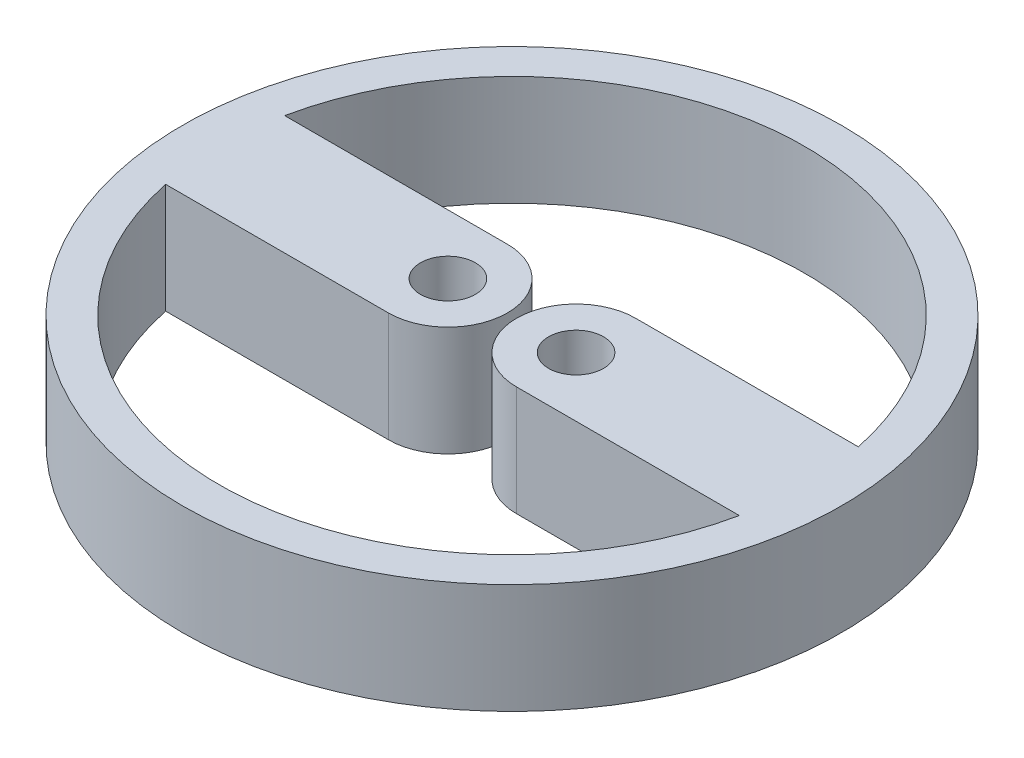
ISO-10303-21;
HEADER;
FILE_DESCRIPTION(('STEP AP214'),'2;1');
FILE_NAME('part.step','',(''),(''),'','','');
FILE_SCHEMA(('AUTOMOTIVE_DESIGN { 1 0 10303 214 1 1 1 1 }'));
ENDSEC;
DATA;
#1=APPLICATION_CONTEXT('core data for automotive mechanical design processes');
#2=APPLICATION_PROTOCOL_DEFINITION('international standard','automotive_design',2000,#1);
#3=PRODUCT_CONTEXT('',#1,'mechanical');
#4=PRODUCT('Part','Part','',(#3));
#5=PRODUCT_RELATED_PRODUCT_CATEGORY('part','',(#4));
#6=PRODUCT_DEFINITION_FORMATION('','',#4);
#7=PRODUCT_DEFINITION_CONTEXT('part definition',#1,'design');
#8=PRODUCT_DEFINITION('design','',#6,#7);
#9=PRODUCT_DEFINITION_SHAPE('','',#8);
#10=(LENGTH_UNIT() NAMED_UNIT(*) SI_UNIT(.MILLI.,.METRE.));
#11=(NAMED_UNIT(*) PLANE_ANGLE_UNIT() SI_UNIT($,.RADIAN.));
#12=(NAMED_UNIT(*) SI_UNIT($,.STERADIAN.) SOLID_ANGLE_UNIT());
#13=UNCERTAINTY_MEASURE_WITH_UNIT(LENGTH_MEASURE(1.E-05),#10,'distance_accuracy_value','');
#14=(GEOMETRIC_REPRESENTATION_CONTEXT(3) GLOBAL_UNCERTAINTY_ASSIGNED_CONTEXT((#13)) GLOBAL_UNIT_ASSIGNED_CONTEXT((#10,
#11,#12)) REPRESENTATION_CONTEXT('',''));
#15=CARTESIAN_POINT('',(0.,0.,0.));
#16=DIRECTION('',(0.,0.,1.));
#17=DIRECTION('',(1.,0.,0.));
#18=AXIS2_PLACEMENT_3D('',#15,#16,#17);
#19=CARTESIAN_POINT('',(0.,6.,0.));
#20=DIRECTION('',(0.,1.,0.));
#21=DIRECTION('',(0.,0.,1.));
#22=AXIS2_PLACEMENT_3D('',#19,#20,#21);
#23=PLANE('',#22);
#24=CARTESIAN_POINT('',(-3.5,6.,0.));
#25=DIRECTION('',(0.,1.,0.));
#26=DIRECTION('',(0.,0.,1.));
#27=AXIS2_PLACEMENT_3D('',#24,#25,#26);
#28=CIRCLE('',#27,1.5);
#29=CARTESIAN_POINT('',(-3.5,6.,1.5));
#30=VERTEX_POINT('',#29);
#31=EDGE_CURVE('E169',#30,#30,#28,.T.);
#32=ORIENTED_EDGE('',*,*,#31,.F.);
#33=EDGE_LOOP('',(#32));
#34=FACE_BOUND('',#33,.T.);
#35=CARTESIAN_POINT('',(0.,6.,0.));
#36=DIRECTION('',(0.,1.,0.));
#37=DIRECTION('',(0.,0.,1.));
#38=AXIS2_PLACEMENT_3D('',#35,#36,#37);
#39=CIRCLE('',#38,18.);
#40=CARTESIAN_POINT('',(0.,6.,18.));
#41=VERTEX_POINT('',#40);
#42=EDGE_CURVE('E11',#41,#41,#39,.T.);
#43=ORIENTED_EDGE('',*,*,#42,.T.);
#44=EDGE_LOOP('',(#43));
#45=FACE_BOUND('',#44,.T.);
#46=CARTESIAN_POINT('',(3.5,6.,0.));
#47=DIRECTION('',(0.,1.,0.));
#48=DIRECTION('',(0.,0.,1.));
#49=AXIS2_PLACEMENT_3D('',#46,#47,#48);
#50=CIRCLE('',#49,1.5);
#51=CARTESIAN_POINT('',(3.5,6.,1.5));
#52=VERTEX_POINT('',#51);
#53=EDGE_CURVE('E163',#52,#52,#50,.T.);
#54=ORIENTED_EDGE('',*,*,#53,.F.);
#55=EDGE_LOOP('',(#54));
#56=FACE_BOUND('',#55,.T.);
#57=DIRECTION('',(-1.,0.,0.));
#58=VECTOR('',#57,1.);
#59=CARTESIAN_POINT('',(3.5,6.,3.25));
#60=LINE('',#59,#58);
#61=CARTESIAN_POINT('',(15.6664450338933,6.,3.25));
#62=VERTEX_POINT('',#61);
#63=CARTESIAN_POINT('',(3.5,6.,3.25));
#64=VERTEX_POINT('',#63);
#65=EDGE_CURVE('E106',#62,#64,#60,.T.);
#66=ORIENTED_EDGE('',*,*,#65,.F.);
#67=CARTESIAN_POINT('',(0.,6.,0.));
#68=DIRECTION('',(0.,1.,0.));
#69=DIRECTION('',(0.,0.,1.));
#70=AXIS2_PLACEMENT_3D('',#67,#68,#69);
#71=CIRCLE('',#70,16.);
#72=CARTESIAN_POINT('',(-15.6664450338933,6.,3.25));
#73=VERTEX_POINT('',#72);
#74=EDGE_CURVE('E98',#73,#62,#71,.T.);
#75=ORIENTED_EDGE('',*,*,#74,.F.);
#76=DIRECTION('',(-1.,0.,0.));
#77=VECTOR('',#76,1.);
#78=CARTESIAN_POINT('',(-3.5,6.,3.25));
#79=LINE('',#78,#77);
#80=CARTESIAN_POINT('',(-3.5,6.,3.25));
#81=VERTEX_POINT('',#80);
#82=EDGE_CURVE('E131',#81,#73,#79,.T.);
#83=ORIENTED_EDGE('',*,*,#82,.F.);
#84=CARTESIAN_POINT('',(-3.5,6.,0.));
#85=DIRECTION('',(0.,-1.,0.));
#86=DIRECTION('',(0.,0.,1.));
#87=AXIS2_PLACEMENT_3D('',#84,#85,#86);
#88=CIRCLE('',#87,3.25);
#89=CARTESIAN_POINT('',(-3.5,6.,-3.25));
#90=VERTEX_POINT('',#89);
#91=EDGE_CURVE('E129',#90,#81,#88,.T.);
#92=ORIENTED_EDGE('',*,*,#91,.F.);
#93=DIRECTION('',(1.,0.,0.));
#94=VECTOR('',#93,1.);
#95=CARTESIAN_POINT('',(-3.5,6.,-3.25));
#96=LINE('',#95,#94);
#97=CARTESIAN_POINT('',(-15.6664450338933,6.,-3.25));
#98=VERTEX_POINT('',#97);
#99=EDGE_CURVE('E127',#98,#90,#96,.T.);
#100=ORIENTED_EDGE('',*,*,#99,.F.);
#101=CARTESIAN_POINT('',(0.,6.,0.));
#102=DIRECTION('',(0.,1.,0.));
#103=DIRECTION('',(0.,0.,1.));
#104=AXIS2_PLACEMENT_3D('',#101,#102,#103);
#105=CIRCLE('',#104,16.);
#106=CARTESIAN_POINT('',(15.6664450338933,6.,-3.25));
#107=VERTEX_POINT('',#106);
#108=EDGE_CURVE('E125',#107,#98,#105,.T.);
#109=ORIENTED_EDGE('',*,*,#108,.F.);
#110=DIRECTION('',(1.,0.,0.));
#111=VECTOR('',#110,1.);
#112=CARTESIAN_POINT('',(3.5,6.,-3.25));
#113=LINE('',#112,#111);
#114=CARTESIAN_POINT('',(3.5,6.,-3.25));
#115=VERTEX_POINT('',#114);
#116=EDGE_CURVE('E121',#115,#107,#113,.T.);
#117=ORIENTED_EDGE('',*,*,#116,.F.);
#118=CARTESIAN_POINT('',(3.5,6.,0.));
#119=DIRECTION('',(0.,-1.,0.));
#120=DIRECTION('',(0.,0.,1.));
#121=AXIS2_PLACEMENT_3D('',#118,#119,#120);
#122=CIRCLE('',#121,3.25);
#123=EDGE_CURVE('E119',#64,#115,#122,.T.);
#124=ORIENTED_EDGE('',*,*,#123,.F.);
#125=EDGE_LOOP('',(#66,#75,#83,#92,#100,#109,#117,#124));
#126=FACE_BOUND('',#125,.T.);
#127=ADVANCED_FACE('F33',(#34,#45,#56,#126),#23,.T.);
#128=CARTESIAN_POINT('',(0.,0.,0.));
#129=DIRECTION('',(0.,1.,0.));
#130=DIRECTION('',(0.,0.,1.));
#131=AXIS2_PLACEMENT_3D('',#128,#129,#130);
#132=PLANE('',#131);
#133=CARTESIAN_POINT('',(3.5,0.,0.));
#134=DIRECTION('',(0.,1.,0.));
#135=DIRECTION('',(0.,0.,1.));
#136=AXIS2_PLACEMENT_3D('',#133,#134,#135);
#137=CIRCLE('',#136,1.5);
#138=CARTESIAN_POINT('',(3.5,0.,1.5));
#139=VERTEX_POINT('',#138);
#140=EDGE_CURVE('E114',#139,#139,#137,.T.);
#141=ORIENTED_EDGE('',*,*,#140,.T.);
#142=EDGE_LOOP('',(#141));
#143=FACE_BOUND('',#142,.T.);
#144=CARTESIAN_POINT('',(-3.5,0.,0.));
#145=DIRECTION('',(0.,1.,0.));
#146=DIRECTION('',(0.,0.,1.));
#147=AXIS2_PLACEMENT_3D('',#144,#145,#146);
#148=CIRCLE('',#147,1.5);
#149=CARTESIAN_POINT('',(-3.5,0.,1.5));
#150=VERTEX_POINT('',#149);
#151=EDGE_CURVE('E166',#150,#150,#148,.T.);
#152=ORIENTED_EDGE('',*,*,#151,.T.);
#153=EDGE_LOOP('',(#152));
#154=FACE_BOUND('',#153,.T.);
#155=CARTESIAN_POINT('',(0.,0.,0.));
#156=DIRECTION('',(0.,1.,0.));
#157=DIRECTION('',(0.,0.,1.));
#158=AXIS2_PLACEMENT_3D('',#155,#156,#157);
#159=CIRCLE('',#158,18.);
#160=CARTESIAN_POINT('',(0.,0.,18.));
#161=VERTEX_POINT('',#160);
#162=EDGE_CURVE('E37',#161,#161,#159,.T.);
#163=ORIENTED_EDGE('',*,*,#162,.F.);
#164=EDGE_LOOP('',(#163));
#165=FACE_BOUND('',#164,.T.);
#166=CARTESIAN_POINT('',(0.,0.,0.));
#167=DIRECTION('',(0.,1.,0.));
#168=DIRECTION('',(0.,0.,1.));
#169=AXIS2_PLACEMENT_3D('',#166,#167,#168);
#170=CIRCLE('',#169,16.);
#171=CARTESIAN_POINT('',(-15.6664450338933,0.,3.25));
#172=VERTEX_POINT('',#171);
#173=CARTESIAN_POINT('',(15.6664450338933,0.,3.25));
#174=VERTEX_POINT('',#173);
#175=EDGE_CURVE('E56',#172,#174,#170,.T.);
#176=ORIENTED_EDGE('',*,*,#175,.T.);
#177=DIRECTION('',(-1.,0.,0.));
#178=VECTOR('',#177,1.);
#179=CARTESIAN_POINT('',(3.5,0.,3.25));
#180=LINE('',#179,#178);
#181=CARTESIAN_POINT('',(3.5,0.,3.25));
#182=VERTEX_POINT('',#181);
#183=EDGE_CURVE('E113',#174,#182,#180,.T.);
#184=ORIENTED_EDGE('',*,*,#183,.T.);
#185=CARTESIAN_POINT('',(3.5,0.,0.));
#186=DIRECTION('',(0.,-1.,0.));
#187=DIRECTION('',(0.,0.,1.));
#188=AXIS2_PLACEMENT_3D('',#185,#186,#187);
#189=CIRCLE('',#188,3.25);
#190=CARTESIAN_POINT('',(3.5,0.,-3.25));
#191=VERTEX_POINT('',#190);
#192=EDGE_CURVE('E135',#182,#191,#189,.T.);
#193=ORIENTED_EDGE('',*,*,#192,.T.);
#194=DIRECTION('',(1.,0.,0.));
#195=VECTOR('',#194,1.);
#196=CARTESIAN_POINT('',(3.5,0.,-3.25));
#197=LINE('',#196,#195);
#198=CARTESIAN_POINT('',(15.6664450338933,0.,-3.25));
#199=VERTEX_POINT('',#198);
#200=EDGE_CURVE('E138',#191,#199,#197,.T.);
#201=ORIENTED_EDGE('',*,*,#200,.T.);
#202=CARTESIAN_POINT('',(0.,0.,0.));
#203=DIRECTION('',(0.,1.,0.));
#204=DIRECTION('',(0.,0.,1.));
#205=AXIS2_PLACEMENT_3D('',#202,#203,#204);
#206=CIRCLE('',#205,16.);
#207=CARTESIAN_POINT('',(-15.6664450338933,0.,-3.25));
#208=VERTEX_POINT('',#207);
#209=EDGE_CURVE('E141',#199,#208,#206,.T.);
#210=ORIENTED_EDGE('',*,*,#209,.T.);
#211=DIRECTION('',(1.,0.,0.));
#212=VECTOR('',#211,1.);
#213=CARTESIAN_POINT('',(-3.5,0.,-3.25));
#214=LINE('',#213,#212);
#215=CARTESIAN_POINT('',(-3.5,0.,-3.25));
#216=VERTEX_POINT('',#215);
#217=EDGE_CURVE('E144',#208,#216,#214,.T.);
#218=ORIENTED_EDGE('',*,*,#217,.T.);
#219=CARTESIAN_POINT('',(-3.5,0.,0.));
#220=DIRECTION('',(0.,-1.,0.));
#221=DIRECTION('',(0.,0.,1.));
#222=AXIS2_PLACEMENT_3D('',#219,#220,#221);
#223=CIRCLE('',#222,3.25);
#224=CARTESIAN_POINT('',(-3.5,0.,3.25));
#225=VERTEX_POINT('',#224);
#226=EDGE_CURVE('E147',#216,#225,#223,.T.);
#227=ORIENTED_EDGE('',*,*,#226,.T.);
#228=DIRECTION('',(-1.,0.,0.));
#229=VECTOR('',#228,1.);
#230=CARTESIAN_POINT('',(-3.5,0.,3.25));
#231=LINE('',#230,#229);
#232=EDGE_CURVE('E107',#225,#172,#231,.T.);
#233=ORIENTED_EDGE('',*,*,#232,.T.);
#234=EDGE_LOOP('',(#176,#184,#193,#201,#210,#218,#227,#233));
#235=FACE_BOUND('',#234,.T.);
#236=ADVANCED_FACE('F175',(#143,#154,#165,#235),#132,.F.);
#237=CARTESIAN_POINT('',(0.,6.,0.));
#238=DIRECTION('',(0.,-1.,0.));
#239=DIRECTION('',(0.,0.,-1.));
#240=AXIS2_PLACEMENT_3D('',#237,#238,#239);
#241=CYLINDRICAL_SURFACE('',#240,18.);
#242=ORIENTED_EDGE('',*,*,#42,.F.);
#243=EDGE_LOOP('',(#242));
#244=FACE_BOUND('',#243,.T.);
#245=ORIENTED_EDGE('',*,*,#162,.T.);
#246=EDGE_LOOP('',(#245));
#247=FACE_BOUND('',#246,.T.);
#248=ADVANCED_FACE('F35',(#244,#247),#241,.T.);
#249=CARTESIAN_POINT('',(-3.5,6.,0.));
#250=DIRECTION('',(0.,-1.,0.));
#251=DIRECTION('',(0.,0.,-1.));
#252=AXIS2_PLACEMENT_3D('',#249,#250,#251);
#253=CYLINDRICAL_SURFACE('',#252,1.5);
#254=ORIENTED_EDGE('',*,*,#31,.T.);
#255=EDGE_LOOP('',(#254));
#256=FACE_BOUND('',#255,.T.);
#257=ORIENTED_EDGE('',*,*,#151,.F.);
#258=EDGE_LOOP('',(#257));
#259=FACE_BOUND('',#258,.T.);
#260=ADVANCED_FACE('F178',(#256,#259),#253,.F.);
#261=CARTESIAN_POINT('',(3.5,6.,0.));
#262=DIRECTION('',(0.,-1.,0.));
#263=DIRECTION('',(0.,0.,-1.));
#264=AXIS2_PLACEMENT_3D('',#261,#262,#263);
#265=CYLINDRICAL_SURFACE('',#264,1.5);
#266=ORIENTED_EDGE('',*,*,#53,.T.);
#267=EDGE_LOOP('',(#266));
#268=FACE_BOUND('',#267,.T.);
#269=ORIENTED_EDGE('',*,*,#140,.F.);
#270=EDGE_LOOP('',(#269));
#271=FACE_BOUND('',#270,.T.);
#272=ADVANCED_FACE('F180',(#268,#271),#265,.F.);
#273=CARTESIAN_POINT('',(0.,6.,0.));
#274=DIRECTION('',(0.,-1.,0.));
#275=DIRECTION('',(0.,0.,-1.));
#276=AXIS2_PLACEMENT_3D('',#273,#274,#275);
#277=CYLINDRICAL_SURFACE('',#276,16.);
#278=ORIENTED_EDGE('',*,*,#175,.F.);
#279=DIRECTION('',(0.,-1.,0.));
#280=VECTOR('',#279,1.);
#281=CARTESIAN_POINT('',(-15.6664450338933,6.,3.25));
#282=LINE('',#281,#280);
#283=EDGE_CURVE('E102',#73,#172,#282,.T.);
#284=ORIENTED_EDGE('',*,*,#283,.F.);
#285=ORIENTED_EDGE('',*,*,#74,.T.);
#286=DIRECTION('',(0.,-1.,0.));
#287=VECTOR('',#286,1.);
#288=CARTESIAN_POINT('',(15.6664450338933,6.,3.25));
#289=LINE('',#288,#287);
#290=EDGE_CURVE('E101',#62,#174,#289,.T.);
#291=ORIENTED_EDGE('',*,*,#290,.T.);
#292=EDGE_LOOP('',(#278,#284,#285,#291));
#293=FACE_BOUND('',#292,.T.);
#294=ADVANCED_FACE('F100',(#293),#277,.F.);
#295=CARTESIAN_POINT('',(3.5,6.,3.25));
#296=DIRECTION('',(0.,0.,1.));
#297=DIRECTION('',(1.,0.,0.));
#298=AXIS2_PLACEMENT_3D('',#295,#296,#297);
#299=PLANE('',#298);
#300=ORIENTED_EDGE('',*,*,#183,.F.);
#301=ORIENTED_EDGE('',*,*,#290,.F.);
#302=ORIENTED_EDGE('',*,*,#65,.T.);
#303=DIRECTION('',(0.,-1.,0.));
#304=VECTOR('',#303,1.);
#305=CARTESIAN_POINT('',(3.5,6.,3.25));
#306=LINE('',#305,#304);
#307=EDGE_CURVE('E115',#64,#182,#306,.T.);
#308=ORIENTED_EDGE('',*,*,#307,.T.);
#309=EDGE_LOOP('',(#300,#301,#302,#308));
#310=FACE_BOUND('',#309,.T.);
#311=ADVANCED_FACE('F110',(#310),#299,.T.);
#312=CARTESIAN_POINT('',(3.5,6.,0.));
#313=DIRECTION('',(0.,-1.,0.));
#314=DIRECTION('',(0.,0.,-1.));
#315=AXIS2_PLACEMENT_3D('',#312,#313,#314);
#316=CYLINDRICAL_SURFACE('',#315,3.25);
#317=ORIENTED_EDGE('',*,*,#192,.F.);
#318=ORIENTED_EDGE('',*,*,#307,.F.);
#319=ORIENTED_EDGE('',*,*,#123,.T.);
#320=DIRECTION('',(0.,-1.,0.));
#321=VECTOR('',#320,1.);
#322=CARTESIAN_POINT('',(3.5,6.,-3.25));
#323=LINE('',#322,#321);
#324=EDGE_CURVE('E160',#115,#191,#323,.T.);
#325=ORIENTED_EDGE('',*,*,#324,.T.);
#326=EDGE_LOOP('',(#317,#318,#319,#325));
#327=FACE_BOUND('',#326,.T.);
#328=ADVANCED_FACE('F230',(#327),#316,.T.);
#329=CARTESIAN_POINT('',(3.5,6.,-3.25));
#330=DIRECTION('',(0.,0.,-1.));
#331=DIRECTION('',(-1.,0.,0.));
#332=AXIS2_PLACEMENT_3D('',#329,#330,#331);
#333=PLANE('',#332);
#334=ORIENTED_EDGE('',*,*,#200,.F.);
#335=ORIENTED_EDGE('',*,*,#324,.F.);
#336=ORIENTED_EDGE('',*,*,#116,.T.);
#337=DIRECTION('',(0.,-1.,0.));
#338=VECTOR('',#337,1.);
#339=CARTESIAN_POINT('',(15.6664450338933,6.,-3.25));
#340=LINE('',#339,#338);
#341=EDGE_CURVE('E158',#107,#199,#340,.T.);
#342=ORIENTED_EDGE('',*,*,#341,.T.);
#343=EDGE_LOOP('',(#334,#335,#336,#342));
#344=FACE_BOUND('',#343,.T.);
#345=ADVANCED_FACE('F227',(#344),#333,.T.);
#346=CARTESIAN_POINT('',(0.,6.,0.));
#347=DIRECTION('',(0.,-1.,0.));
#348=DIRECTION('',(0.,0.,-1.));
#349=AXIS2_PLACEMENT_3D('',#346,#347,#348);
#350=CYLINDRICAL_SURFACE('',#349,16.);
#351=ORIENTED_EDGE('',*,*,#209,.F.);
#352=ORIENTED_EDGE('',*,*,#341,.F.);
#353=ORIENTED_EDGE('',*,*,#108,.T.);
#354=DIRECTION('',(0.,-1.,0.));
#355=VECTOR('',#354,1.);
#356=CARTESIAN_POINT('',(-15.6664450338933,6.,-3.25));
#357=LINE('',#356,#355);
#358=EDGE_CURVE('E156',#98,#208,#357,.T.);
#359=ORIENTED_EDGE('',*,*,#358,.T.);
#360=EDGE_LOOP('',(#351,#352,#353,#359));
#361=FACE_BOUND('',#360,.T.);
#362=ADVANCED_FACE('F222',(#361),#350,.F.);
#363=CARTESIAN_POINT('',(-3.5,6.,-3.25));
#364=DIRECTION('',(0.,0.,-1.));
#365=DIRECTION('',(-1.,0.,0.));
#366=AXIS2_PLACEMENT_3D('',#363,#364,#365);
#367=PLANE('',#366);
#368=ORIENTED_EDGE('',*,*,#217,.F.);
#369=ORIENTED_EDGE('',*,*,#358,.F.);
#370=ORIENTED_EDGE('',*,*,#99,.T.);
#371=DIRECTION('',(0.,-1.,0.));
#372=VECTOR('',#371,1.);
#373=CARTESIAN_POINT('',(-3.5,6.,-3.25));
#374=LINE('',#373,#372);
#375=EDGE_CURVE('E154',#90,#216,#374,.T.);
#376=ORIENTED_EDGE('',*,*,#375,.T.);
#377=EDGE_LOOP('',(#368,#369,#370,#376));
#378=FACE_BOUND('',#377,.T.);
#379=ADVANCED_FACE('F218',(#378),#367,.T.);
#380=CARTESIAN_POINT('',(-3.5,6.,0.));
#381=DIRECTION('',(0.,-1.,0.));
#382=DIRECTION('',(0.,0.,-1.));
#383=AXIS2_PLACEMENT_3D('',#380,#381,#382);
#384=CYLINDRICAL_SURFACE('',#383,3.25);
#385=ORIENTED_EDGE('',*,*,#226,.F.);
#386=ORIENTED_EDGE('',*,*,#375,.F.);
#387=ORIENTED_EDGE('',*,*,#91,.T.);
#388=DIRECTION('',(0.,-1.,0.));
#389=VECTOR('',#388,1.);
#390=CARTESIAN_POINT('',(-3.5,6.,3.25));
#391=LINE('',#390,#389);
#392=EDGE_CURVE('E48',#81,#225,#391,.T.);
#393=ORIENTED_EDGE('',*,*,#392,.T.);
#394=EDGE_LOOP('',(#385,#386,#387,#393));
#395=FACE_BOUND('',#394,.T.);
#396=ADVANCED_FACE('F215',(#395),#384,.T.);
#397=CARTESIAN_POINT('',(-3.5,6.,3.25));
#398=DIRECTION('',(0.,0.,1.));
#399=DIRECTION('',(1.,0.,0.));
#400=AXIS2_PLACEMENT_3D('',#397,#398,#399);
#401=PLANE('',#400);
#402=ORIENTED_EDGE('',*,*,#232,.F.);
#403=ORIENTED_EDGE('',*,*,#392,.F.);
#404=ORIENTED_EDGE('',*,*,#82,.T.);
#405=ORIENTED_EDGE('',*,*,#283,.T.);
#406=EDGE_LOOP('',(#402,#403,#404,#405));
#407=FACE_BOUND('',#406,.T.);
#408=ADVANCED_FACE('F209',(#407),#401,.T.);
#409=CLOSED_SHELL('',(#127,#236,#248,#260,#272,#294,#311,#328,#345,#362,#379,#396,#408));
#410=MANIFOLD_SOLID_BREP('B2',#409);
#411=ADVANCED_BREP_SHAPE_REPRESENTATION('',(#18,#410),#14);
#412=SHAPE_DEFINITION_REPRESENTATION(#9,#411);
ENDSEC;
END-ISO-10303-21;
